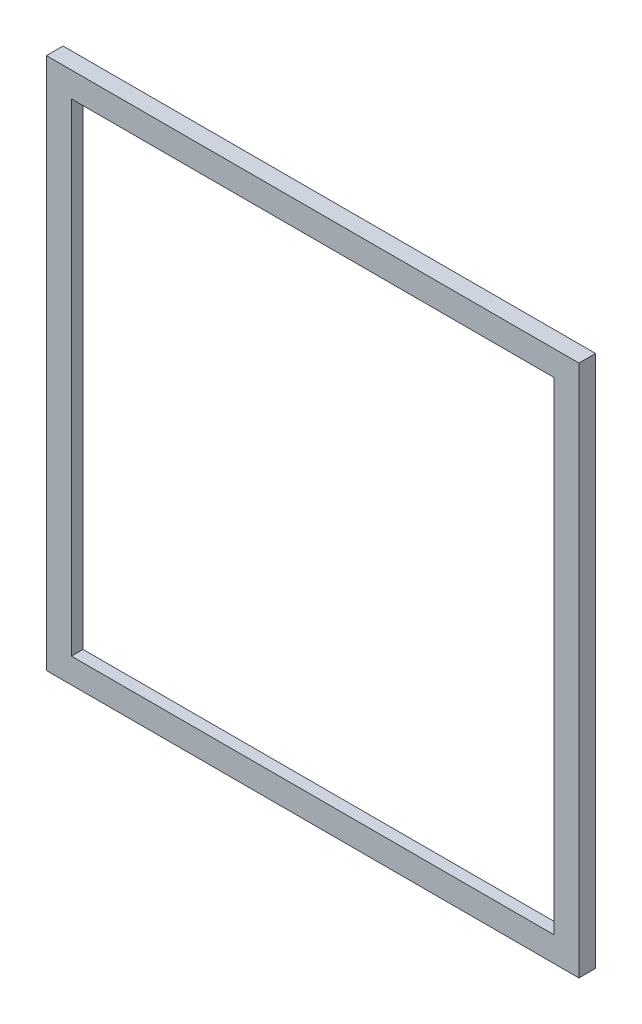
ISO-10303-21;
HEADER;
FILE_DESCRIPTION(('STEP AP214'),'2;1');
FILE_NAME('part.step','',(''),(''),'','','');
FILE_SCHEMA(('AUTOMOTIVE_DESIGN { 1 0 10303 214 1 1 1 1 }'));
ENDSEC;
DATA;
#1=APPLICATION_CONTEXT('core data for automotive mechanical design processes');
#2=APPLICATION_PROTOCOL_DEFINITION('international standard','automotive_design',2000,#1);
#3=PRODUCT_CONTEXT('',#1,'mechanical');
#4=PRODUCT('Part','Part','',(#3));
#5=PRODUCT_RELATED_PRODUCT_CATEGORY('part','',(#4));
#6=PRODUCT_DEFINITION_FORMATION('','',#4);
#7=PRODUCT_DEFINITION_CONTEXT('part definition',#1,'design');
#8=PRODUCT_DEFINITION('design','',#6,#7);
#9=PRODUCT_DEFINITION_SHAPE('','',#8);
#10=(LENGTH_UNIT() NAMED_UNIT(*) SI_UNIT(.MILLI.,.METRE.));
#11=(NAMED_UNIT(*) PLANE_ANGLE_UNIT() SI_UNIT($,.RADIAN.));
#12=(NAMED_UNIT(*) SI_UNIT($,.STERADIAN.) SOLID_ANGLE_UNIT());
#13=UNCERTAINTY_MEASURE_WITH_UNIT(LENGTH_MEASURE(1.E-05),#10,'distance_accuracy_value','');
#14=(GEOMETRIC_REPRESENTATION_CONTEXT(3) GLOBAL_UNCERTAINTY_ASSIGNED_CONTEXT((#13)) GLOBAL_UNIT_ASSIGNED_CONTEXT((#10,
#11,#12)) REPRESENTATION_CONTEXT('',''));
#15=CARTESIAN_POINT('',(0.,0.,0.));
#16=DIRECTION('',(0.,0.,1.));
#17=DIRECTION('',(1.,0.,0.));
#18=AXIS2_PLACEMENT_3D('',#15,#16,#17);
#19=CARTESIAN_POINT('',(5.,295.,10.));
#20=DIRECTION('',(0.,-1.,0.));
#21=DIRECTION('',(0.,0.,-1.));
#22=AXIS2_PLACEMENT_3D('',#19,#20,#21);
#23=PLANE('',#22);
#24=DIRECTION('',(0.,0.,-1.));
#25=VECTOR('',#24,1.);
#26=CARTESIAN_POINT('',(5.,295.,10.));
#27=LINE('',#26,#25);
#28=CARTESIAN_POINT('',(5.,295.,10.));
#29=VERTEX_POINT('',#28);
#30=CARTESIAN_POINT('',(5.,295.,3.));
#31=VERTEX_POINT('',#30);
#32=EDGE_CURVE('E183',#29,#31,#27,.T.);
#33=ORIENTED_EDGE('',*,*,#32,.T.);
#34=DIRECTION('',(1.,0.,0.));
#35=VECTOR('',#34,1.);
#36=CARTESIAN_POINT('',(5.,295.,3.));
#37=LINE('',#36,#35);
#38=CARTESIAN_POINT('',(295.,295.,3.));
#39=VERTEX_POINT('',#38);
#40=EDGE_CURVE('E162',#31,#39,#37,.T.);
#41=ORIENTED_EDGE('',*,*,#40,.T.);
#42=DIRECTION('',(0.,0.,-1.));
#43=VECTOR('',#42,1.);
#44=CARTESIAN_POINT('',(295.,295.,10.));
#45=LINE('',#44,#43);
#46=CARTESIAN_POINT('',(295.,295.,10.));
#47=VERTEX_POINT('',#46);
#48=EDGE_CURVE('E174',#47,#39,#45,.T.);
#49=ORIENTED_EDGE('',*,*,#48,.F.);
#50=DIRECTION('',(-1.,0.,0.));
#51=VECTOR('',#50,1.);
#52=CARTESIAN_POINT('',(5.,295.,10.));
#53=LINE('',#52,#51);
#54=EDGE_CURVE('E165',#47,#29,#53,.T.);
#55=ORIENTED_EDGE('',*,*,#54,.T.);
#56=EDGE_LOOP('',(#33,#41,#49,#55));
#57=FACE_BOUND('',#56,.T.);
#58=ADVANCED_FACE('F32',(#57),#23,.T.);
#59=CARTESIAN_POINT('',(5.,5.,10.));
#60=DIRECTION('',(1.,0.,0.));
#61=DIRECTION('',(0.,0.,-1.));
#62=AXIS2_PLACEMENT_3D('',#59,#60,#61);
#63=PLANE('',#62);
#64=DIRECTION('',(0.,0.,-1.));
#65=VECTOR('',#64,1.);
#66=CARTESIAN_POINT('',(5.,5.,10.));
#67=LINE('',#66,#65);
#68=CARTESIAN_POINT('',(5.,5.,10.));
#69=VERTEX_POINT('',#68);
#70=CARTESIAN_POINT('',(4.99999999999995,5.,3.));
#71=VERTEX_POINT('',#70);
#72=EDGE_CURVE('E180',#69,#71,#67,.T.);
#73=ORIENTED_EDGE('',*,*,#72,.T.);
#74=DIRECTION('',(0.,1.,0.));
#75=VECTOR('',#74,1.);
#76=CARTESIAN_POINT('',(5.,5.,3.));
#77=LINE('',#76,#75);
#78=EDGE_CURVE('E159',#71,#31,#77,.T.);
#79=ORIENTED_EDGE('',*,*,#78,.T.);
#80=ORIENTED_EDGE('',*,*,#32,.F.);
#81=DIRECTION('',(0.,-1.,0.));
#82=VECTOR('',#81,1.);
#83=CARTESIAN_POINT('',(5.,5.,10.));
#84=LINE('',#83,#82);
#85=EDGE_CURVE('E167',#29,#69,#84,.T.);
#86=ORIENTED_EDGE('',*,*,#85,.T.);
#87=EDGE_LOOP('',(#73,#79,#80,#86));
#88=FACE_BOUND('',#87,.T.);
#89=ADVANCED_FACE('F246',(#88),#63,.T.);
#90=CARTESIAN_POINT('',(295.,5.,10.));
#91=DIRECTION('',(0.,1.,0.));
#92=DIRECTION('',(0.,0.,1.));
#93=AXIS2_PLACEMENT_3D('',#90,#91,#92);
#94=PLANE('',#93);
#95=DIRECTION('',(0.,0.,-1.));
#96=VECTOR('',#95,1.);
#97=CARTESIAN_POINT('',(295.,5.,10.));
#98=LINE('',#97,#96);
#99=CARTESIAN_POINT('',(295.,5.,10.));
#100=VERTEX_POINT('',#99);
#101=CARTESIAN_POINT('',(295.,5.,3.));
#102=VERTEX_POINT('',#101);
#103=EDGE_CURVE('E177',#100,#102,#98,.T.);
#104=ORIENTED_EDGE('',*,*,#103,.T.);
#105=DIRECTION('',(-1.,0.,0.));
#106=VECTOR('',#105,1.);
#107=CARTESIAN_POINT('',(295.,5.,3.));
#108=LINE('',#107,#106);
#109=EDGE_CURVE('E55',#102,#71,#108,.T.);
#110=ORIENTED_EDGE('',*,*,#109,.T.);
#111=ORIENTED_EDGE('',*,*,#72,.F.);
#112=DIRECTION('',(1.,0.,0.));
#113=VECTOR('',#112,1.);
#114=CARTESIAN_POINT('',(295.,5.,10.));
#115=LINE('',#114,#113);
#116=EDGE_CURVE('E169',#69,#100,#115,.T.);
#117=ORIENTED_EDGE('',*,*,#116,.T.);
#118=EDGE_LOOP('',(#104,#110,#111,#117));
#119=FACE_BOUND('',#118,.T.);
#120=ADVANCED_FACE('F249',(#119),#94,.T.);
#121=CARTESIAN_POINT('',(295.,5.,10.));
#122=DIRECTION('',(-1.,0.,0.));
#123=DIRECTION('',(0.,0.,1.));
#124=AXIS2_PLACEMENT_3D('',#121,#122,#123);
#125=PLANE('',#124);
#126=ORIENTED_EDGE('',*,*,#48,.T.);
#127=DIRECTION('',(0.,-1.,0.));
#128=VECTOR('',#127,1.);
#129=CARTESIAN_POINT('',(295.,5.,3.));
#130=LINE('',#129,#128);
#131=EDGE_CURVE('E11',#39,#102,#130,.T.);
#132=ORIENTED_EDGE('',*,*,#131,.T.);
#133=ORIENTED_EDGE('',*,*,#103,.F.);
#134=DIRECTION('',(0.,1.,0.));
#135=VECTOR('',#134,1.);
#136=CARTESIAN_POINT('',(295.,5.,10.));
#137=LINE('',#136,#135);
#138=EDGE_CURVE('E172',#100,#47,#137,.T.);
#139=ORIENTED_EDGE('',*,*,#138,.T.);
#140=EDGE_LOOP('',(#126,#132,#133,#139));
#141=FACE_BOUND('',#140,.T.);
#142=ADVANCED_FACE('F236',(#141),#125,.T.);
#143=CARTESIAN_POINT('',(0.,0.,10.));
#144=DIRECTION('',(0.,0.,-1.));
#145=DIRECTION('',(-1.,0.,0.));
#146=AXIS2_PLACEMENT_3D('',#143,#144,#145);
#147=PLANE('',#146);
#148=DIRECTION('',(0.,-1.,0.));
#149=VECTOR('',#148,1.);
#150=CARTESIAN_POINT('',(-10.,-10.,10.));
#151=LINE('',#150,#149);
#152=CARTESIAN_POINT('',(-10.,310.,10.));
#153=VERTEX_POINT('',#152);
#154=CARTESIAN_POINT('',(-10.,-10.,10.));
#155=VERTEX_POINT('',#154);
#156=EDGE_CURVE('E187',#153,#155,#151,.T.);
#157=ORIENTED_EDGE('',*,*,#156,.T.);
#158=DIRECTION('',(1.,0.,0.));
#159=VECTOR('',#158,1.);
#160=CARTESIAN_POINT('',(-10.,-10.,10.));
#161=LINE('',#160,#159);
#162=CARTESIAN_POINT('',(310.,-10.,10.));
#163=VERTEX_POINT('',#162);
#164=EDGE_CURVE('E190',#155,#163,#161,.T.);
#165=ORIENTED_EDGE('',*,*,#164,.T.);
#166=DIRECTION('',(0.,1.,0.));
#167=VECTOR('',#166,1.);
#168=CARTESIAN_POINT('',(310.,-10.,10.));
#169=LINE('',#168,#167);
#170=CARTESIAN_POINT('',(310.,310.,10.));
#171=VERTEX_POINT('',#170);
#172=EDGE_CURVE('E193',#163,#171,#169,.T.);
#173=ORIENTED_EDGE('',*,*,#172,.T.);
#174=DIRECTION('',(-1.,0.,0.));
#175=VECTOR('',#174,1.);
#176=CARTESIAN_POINT('',(-10.,310.,10.));
#177=LINE('',#176,#175);
#178=EDGE_CURVE('E195',#171,#153,#177,.T.);
#179=ORIENTED_EDGE('',*,*,#178,.T.);
#180=EDGE_LOOP('',(#157,#165,#173,#179));
#181=FACE_BOUND('',#180,.T.);
#182=ORIENTED_EDGE('',*,*,#54,.F.);
#183=ORIENTED_EDGE('',*,*,#138,.F.);
#184=ORIENTED_EDGE('',*,*,#116,.F.);
#185=ORIENTED_EDGE('',*,*,#85,.F.);
#186=EDGE_LOOP('',(#182,#183,#184,#185));
#187=FACE_BOUND('',#186,.T.);
#188=ADVANCED_FACE('F233',(#181,#187),#147,.F.);
#189=CARTESIAN_POINT('',(0.,0.,0.));
#190=DIRECTION('',(0.,0.,-1.));
#191=DIRECTION('',(-1.,0.,0.));
#192=AXIS2_PLACEMENT_3D('',#189,#190,#191);
#193=PLANE('',#192);
#194=DIRECTION('',(0.,1.,0.));
#195=VECTOR('',#194,1.);
#196=CARTESIAN_POINT('',(0.,0.,0.));
#197=LINE('',#196,#195);
#198=CARTESIAN_POINT('',(0.,0.,0.));
#199=VERTEX_POINT('',#198);
#200=CARTESIAN_POINT('',(0.,300.,0.));
#201=VERTEX_POINT('',#200);
#202=EDGE_CURVE('E47',#199,#201,#197,.T.);
#203=ORIENTED_EDGE('',*,*,#202,.F.);
#204=DIRECTION('',(-1.,0.,0.));
#205=VECTOR('',#204,1.);
#206=CARTESIAN_POINT('',(0.,0.,0.));
#207=LINE('',#206,#205);
#208=CARTESIAN_POINT('',(300.,0.,0.));
#209=VERTEX_POINT('',#208);
#210=EDGE_CURVE('E140',#209,#199,#207,.T.);
#211=ORIENTED_EDGE('',*,*,#210,.F.);
#212=DIRECTION('',(0.,-1.,0.));
#213=VECTOR('',#212,1.);
#214=CARTESIAN_POINT('',(300.,0.,0.));
#215=LINE('',#214,#213);
#216=CARTESIAN_POINT('',(300.,300.,0.));
#217=VERTEX_POINT('',#216);
#218=EDGE_CURVE('E143',#217,#209,#215,.T.);
#219=ORIENTED_EDGE('',*,*,#218,.F.);
#220=DIRECTION('',(1.,0.,0.));
#221=VECTOR('',#220,1.);
#222=CARTESIAN_POINT('',(0.,300.,0.));
#223=LINE('',#222,#221);
#224=EDGE_CURVE('E149',#201,#217,#223,.T.);
#225=ORIENTED_EDGE('',*,*,#224,.F.);
#226=EDGE_LOOP('',(#203,#211,#219,#225));
#227=FACE_BOUND('',#226,.T.);
#228=DIRECTION('',(0.,-1.,0.));
#229=VECTOR('',#228,1.);
#230=CARTESIAN_POINT('',(-10.,-10.,0.));
#231=LINE('',#230,#229);
#232=CARTESIAN_POINT('',(-10.,310.,0.));
#233=VERTEX_POINT('',#232);
#234=CARTESIAN_POINT('',(-10.,-10.,0.));
#235=VERTEX_POINT('',#234);
#236=EDGE_CURVE('E186',#233,#235,#231,.T.);
#237=ORIENTED_EDGE('',*,*,#236,.F.);
#238=DIRECTION('',(-1.,0.,0.));
#239=VECTOR('',#238,1.);
#240=CARTESIAN_POINT('',(-10.,310.,0.));
#241=LINE('',#240,#239);
#242=CARTESIAN_POINT('',(310.,310.,0.));
#243=VERTEX_POINT('',#242);
#244=EDGE_CURVE('E191',#243,#233,#241,.T.);
#245=ORIENTED_EDGE('',*,*,#244,.F.);
#246=DIRECTION('',(0.,1.,0.));
#247=VECTOR('',#246,1.);
#248=CARTESIAN_POINT('',(310.,-10.,0.));
#249=LINE('',#248,#247);
#250=CARTESIAN_POINT('',(310.,-10.,0.));
#251=VERTEX_POINT('',#250);
#252=EDGE_CURVE('E202',#251,#243,#249,.T.);
#253=ORIENTED_EDGE('',*,*,#252,.F.);
#254=DIRECTION('',(1.,0.,0.));
#255=VECTOR('',#254,1.);
#256=CARTESIAN_POINT('',(-10.,-10.,0.));
#257=LINE('',#256,#255);
#258=EDGE_CURVE('E200',#235,#251,#257,.T.);
#259=ORIENTED_EDGE('',*,*,#258,.F.);
#260=EDGE_LOOP('',(#237,#245,#253,#259));
#261=FACE_BOUND('',#260,.T.);
#262=ADVANCED_FACE('F223',(#227,#261),#193,.T.);
#263=CARTESIAN_POINT('',(-10.,-10.,10.));
#264=DIRECTION('',(1.,0.,0.));
#265=DIRECTION('',(0.,0.,-1.));
#266=AXIS2_PLACEMENT_3D('',#263,#264,#265);
#267=PLANE('',#266);
#268=ORIENTED_EDGE('',*,*,#236,.T.);
#269=DIRECTION('',(0.,0.,-1.));
#270=VECTOR('',#269,1.);
#271=CARTESIAN_POINT('',(-10.,-10.,10.));
#272=LINE('',#271,#270);
#273=EDGE_CURVE('E40',#155,#235,#272,.T.);
#274=ORIENTED_EDGE('',*,*,#273,.F.);
#275=ORIENTED_EDGE('',*,*,#156,.F.);
#276=DIRECTION('',(0.,0.,-1.));
#277=VECTOR('',#276,1.);
#278=CARTESIAN_POINT('',(-10.,310.,10.));
#279=LINE('',#278,#277);
#280=EDGE_CURVE('E197',#153,#233,#279,.T.);
#281=ORIENTED_EDGE('',*,*,#280,.T.);
#282=EDGE_LOOP('',(#268,#274,#275,#281));
#283=FACE_BOUND('',#282,.T.);
#284=ADVANCED_FACE('F34',(#283),#267,.F.);
#285=CARTESIAN_POINT('',(-10.,-10.,10.));
#286=DIRECTION('',(0.,1.,0.));
#287=DIRECTION('',(0.,0.,1.));
#288=AXIS2_PLACEMENT_3D('',#285,#286,#287);
#289=PLANE('',#288);
#290=ORIENTED_EDGE('',*,*,#258,.T.);
#291=DIRECTION('',(0.,0.,-1.));
#292=VECTOR('',#291,1.);
#293=CARTESIAN_POINT('',(310.,-10.,10.));
#294=LINE('',#293,#292);
#295=EDGE_CURVE('E210',#163,#251,#294,.T.);
#296=ORIENTED_EDGE('',*,*,#295,.F.);
#297=ORIENTED_EDGE('',*,*,#164,.F.);
#298=ORIENTED_EDGE('',*,*,#273,.T.);
#299=EDGE_LOOP('',(#290,#296,#297,#298));
#300=FACE_BOUND('',#299,.T.);
#301=ADVANCED_FACE('F215',(#300),#289,.F.);
#302=CARTESIAN_POINT('',(310.,-10.,10.));
#303=DIRECTION('',(-1.,0.,0.));
#304=DIRECTION('',(0.,0.,1.));
#305=AXIS2_PLACEMENT_3D('',#302,#303,#304);
#306=PLANE('',#305);
#307=ORIENTED_EDGE('',*,*,#252,.T.);
#308=DIRECTION('',(0.,0.,-1.));
#309=VECTOR('',#308,1.);
#310=CARTESIAN_POINT('',(310.,310.,10.));
#311=LINE('',#310,#309);
#312=EDGE_CURVE('E207',#171,#243,#311,.T.);
#313=ORIENTED_EDGE('',*,*,#312,.F.);
#314=ORIENTED_EDGE('',*,*,#172,.F.);
#315=ORIENTED_EDGE('',*,*,#295,.T.);
#316=EDGE_LOOP('',(#307,#313,#314,#315));
#317=FACE_BOUND('',#316,.T.);
#318=ADVANCED_FACE('F227',(#317),#306,.F.);
#319=CARTESIAN_POINT('',(-10.,310.,10.));
#320=DIRECTION('',(0.,-1.,0.));
#321=DIRECTION('',(0.,0.,-1.));
#322=AXIS2_PLACEMENT_3D('',#319,#320,#321);
#323=PLANE('',#322);
#324=ORIENTED_EDGE('',*,*,#244,.T.);
#325=ORIENTED_EDGE('',*,*,#280,.F.);
#326=ORIENTED_EDGE('',*,*,#178,.F.);
#327=ORIENTED_EDGE('',*,*,#312,.T.);
#328=EDGE_LOOP('',(#324,#325,#326,#327));
#329=FACE_BOUND('',#328,.T.);
#330=ADVANCED_FACE('F231',(#329),#323,.F.);
#331=CARTESIAN_POINT('',(0.,0.,3.));
#332=DIRECTION('',(-1.,0.,0.));
#333=DIRECTION('',(0.,0.,1.));
#334=AXIS2_PLACEMENT_3D('',#331,#332,#333);
#335=PLANE('',#334);
#336=ORIENTED_EDGE('',*,*,#202,.T.);
#337=DIRECTION('',(0.,0.,-1.));
#338=VECTOR('',#337,1.);
#339=CARTESIAN_POINT('',(0.,300.,3.));
#340=LINE('',#339,#338);
#341=CARTESIAN_POINT('',(0.,300.,3.));
#342=VERTEX_POINT('',#341);
#343=EDGE_CURVE('E118',#342,#201,#340,.T.);
#344=ORIENTED_EDGE('',*,*,#343,.F.);
#345=DIRECTION('',(0.,1.,0.));
#346=VECTOR('',#345,1.);
#347=CARTESIAN_POINT('',(0.,0.,3.));
#348=LINE('',#347,#346);
#349=CARTESIAN_POINT('',(0.,0.,3.));
#350=VERTEX_POINT('',#349);
#351=EDGE_CURVE('E122',#350,#342,#348,.T.);
#352=ORIENTED_EDGE('',*,*,#351,.F.);
#353=DIRECTION('',(0.,0.,-1.));
#354=VECTOR('',#353,1.);
#355=CARTESIAN_POINT('',(0.,0.,3.));
#356=LINE('',#355,#354);
#357=EDGE_CURVE('E153',#350,#199,#356,.T.);
#358=ORIENTED_EDGE('',*,*,#357,.T.);
#359=EDGE_LOOP('',(#336,#344,#352,#358));
#360=FACE_BOUND('',#359,.T.);
#361=ADVANCED_FACE('F120',(#360),#335,.F.);
#362=CARTESIAN_POINT('',(0.,0.,3.));
#363=DIRECTION('',(0.,-1.,0.));
#364=DIRECTION('',(1.,0.,0.));
#365=AXIS2_PLACEMENT_3D('',#362,#363,#364);
#366=PLANE('',#365);
#367=ORIENTED_EDGE('',*,*,#210,.T.);
#368=ORIENTED_EDGE('',*,*,#357,.F.);
#369=DIRECTION('',(-1.,0.,0.));
#370=VECTOR('',#369,1.);
#371=CARTESIAN_POINT('',(0.,0.,3.));
#372=LINE('',#371,#370);
#373=CARTESIAN_POINT('',(300.,0.,3.));
#374=VERTEX_POINT('',#373);
#375=EDGE_CURVE('E128',#374,#350,#372,.T.);
#376=ORIENTED_EDGE('',*,*,#375,.F.);
#377=DIRECTION('',(0.,0.,-1.));
#378=VECTOR('',#377,1.);
#379=CARTESIAN_POINT('',(300.,0.,3.));
#380=LINE('',#379,#378);
#381=EDGE_CURVE('E155',#374,#209,#380,.T.);
#382=ORIENTED_EDGE('',*,*,#381,.T.);
#383=EDGE_LOOP('',(#367,#368,#376,#382));
#384=FACE_BOUND('',#383,.T.);
#385=ADVANCED_FACE('F331',(#384),#366,.F.);
#386=CARTESIAN_POINT('',(300.,0.,3.));
#387=DIRECTION('',(1.,0.,0.));
#388=DIRECTION('',(0.,0.,-1.));
#389=AXIS2_PLACEMENT_3D('',#386,#387,#388);
#390=PLANE('',#389);
#391=ORIENTED_EDGE('',*,*,#218,.T.);
#392=ORIENTED_EDGE('',*,*,#381,.F.);
#393=DIRECTION('',(0.,-1.,0.));
#394=VECTOR('',#393,1.);
#395=CARTESIAN_POINT('',(300.,0.,3.));
#396=LINE('',#395,#394);
#397=CARTESIAN_POINT('',(300.,300.,3.));
#398=VERTEX_POINT('',#397);
#399=EDGE_CURVE('E136',#398,#374,#396,.T.);
#400=ORIENTED_EDGE('',*,*,#399,.F.);
#401=DIRECTION('',(0.,0.,-1.));
#402=VECTOR('',#401,1.);
#403=CARTESIAN_POINT('',(300.,300.,3.));
#404=LINE('',#403,#402);
#405=EDGE_CURVE('E127',#398,#217,#404,.T.);
#406=ORIENTED_EDGE('',*,*,#405,.T.);
#407=EDGE_LOOP('',(#391,#392,#400,#406));
#408=FACE_BOUND('',#407,.T.);
#409=ADVANCED_FACE('F338',(#408),#390,.F.);
#410=CARTESIAN_POINT('',(0.,300.,3.));
#411=DIRECTION('',(0.,1.,0.));
#412=DIRECTION('',(-1.,0.,0.));
#413=AXIS2_PLACEMENT_3D('',#410,#411,#412);
#414=PLANE('',#413);
#415=ORIENTED_EDGE('',*,*,#224,.T.);
#416=ORIENTED_EDGE('',*,*,#405,.F.);
#417=DIRECTION('',(1.,0.,0.));
#418=VECTOR('',#417,1.);
#419=CARTESIAN_POINT('',(0.,300.,3.));
#420=LINE('',#419,#418);
#421=EDGE_CURVE('E131',#342,#398,#420,.T.);
#422=ORIENTED_EDGE('',*,*,#421,.F.);
#423=ORIENTED_EDGE('',*,*,#343,.T.);
#424=EDGE_LOOP('',(#415,#416,#422,#423));
#425=FACE_BOUND('',#424,.T.);
#426=ADVANCED_FACE('F132',(#425),#414,.F.);
#427=CARTESIAN_POINT('',(0.,0.,3.));
#428=DIRECTION('',(0.,0.,-1.));
#429=DIRECTION('',(-1.,0.,0.));
#430=AXIS2_PLACEMENT_3D('',#427,#428,#429);
#431=PLANE('',#430);
#432=ORIENTED_EDGE('',*,*,#78,.F.);
#433=ORIENTED_EDGE('',*,*,#109,.F.);
#434=ORIENTED_EDGE('',*,*,#131,.F.);
#435=ORIENTED_EDGE('',*,*,#40,.F.);
#436=EDGE_LOOP('',(#432,#433,#434,#435));
#437=FACE_BOUND('',#436,.T.);
#438=ORIENTED_EDGE('',*,*,#351,.T.);
#439=ORIENTED_EDGE('',*,*,#421,.T.);
#440=ORIENTED_EDGE('',*,*,#399,.T.);
#441=ORIENTED_EDGE('',*,*,#375,.T.);
#442=EDGE_LOOP('',(#438,#439,#440,#441));
#443=FACE_BOUND('',#442,.T.);
#444=ADVANCED_FACE('F138',(#437,#443),#431,.T.);
#445=CLOSED_SHELL('',(#58,#89,#120,#142,#188,#262,#284,#301,#318,#330,#361,#385,#409,#426,#444));
#446=MANIFOLD_SOLID_BREP('B2',#445);
#447=ADVANCED_BREP_SHAPE_REPRESENTATION('',(#18,#446),#14);
#448=SHAPE_DEFINITION_REPRESENTATION(#9,#447);
ENDSEC;
END-ISO-10303-21;
